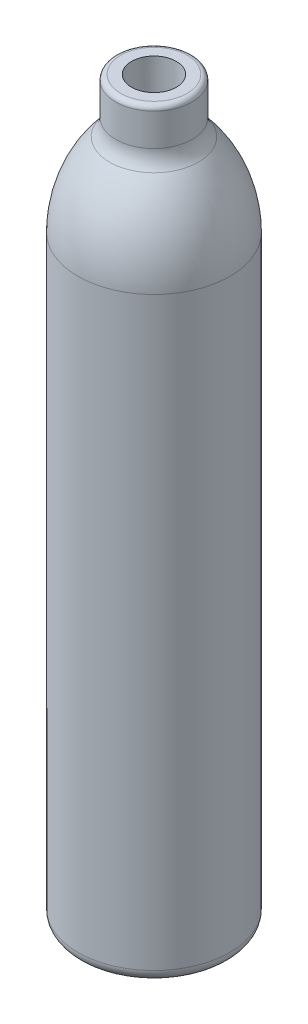
ISO-10303-21;
HEADER;
FILE_DESCRIPTION(('STEP AP214'),'2;1');
FILE_NAME('part.step','',(''),(''),'','','');
FILE_SCHEMA(('AUTOMOTIVE_DESIGN { 1 0 10303 214 1 1 1 1 }'));
ENDSEC;
DATA;
#1=APPLICATION_CONTEXT('core data for automotive mechanical design processes');
#2=APPLICATION_PROTOCOL_DEFINITION('international standard','automotive_design',2000,#1);
#3=PRODUCT_CONTEXT('',#1,'mechanical');
#4=PRODUCT('Part','Part','',(#3));
#5=PRODUCT_RELATED_PRODUCT_CATEGORY('part','',(#4));
#6=PRODUCT_DEFINITION_FORMATION('','',#4);
#7=PRODUCT_DEFINITION_CONTEXT('part definition',#1,'design');
#8=PRODUCT_DEFINITION('design','',#6,#7);
#9=PRODUCT_DEFINITION_SHAPE('','',#8);
#10=(LENGTH_UNIT() NAMED_UNIT(*) SI_UNIT(.MILLI.,.METRE.));
#11=(NAMED_UNIT(*) PLANE_ANGLE_UNIT() SI_UNIT($,.RADIAN.));
#12=(NAMED_UNIT(*) SI_UNIT($,.STERADIAN.) SOLID_ANGLE_UNIT());
#13=UNCERTAINTY_MEASURE_WITH_UNIT(LENGTH_MEASURE(1.E-05),#10,'distance_accuracy_value','');
#14=(GEOMETRIC_REPRESENTATION_CONTEXT(3) GLOBAL_UNCERTAINTY_ASSIGNED_CONTEXT((#13)) GLOBAL_UNIT_ASSIGNED_CONTEXT((#10,
#11,#12)) REPRESENTATION_CONTEXT('',''));
#15=CARTESIAN_POINT('',(0.,0.,0.));
#16=DIRECTION('',(0.,0.,1.));
#17=DIRECTION('',(1.,0.,0.));
#18=AXIS2_PLACEMENT_3D('',#15,#16,#17);
#19=CARTESIAN_POINT('',(13.3,129.302861252312,0.));
#20=DIRECTION('',(0.,-1.,0.));
#21=DIRECTION('',(1.,0.,0.));
#22=AXIS2_PLACEMENT_3D('',#19,#20,#21);
#23=PLANE('',#22);
#24=CARTESIAN_POINT('',(0.,129.302861252312,0.));
#25=DIRECTION('',(0.,-1.,0.));
#26=DIRECTION('',(1.,0.,0.));
#27=AXIS2_PLACEMENT_3D('',#24,#25,#26);
#28=CIRCLE('',#27,9.);
#29=CARTESIAN_POINT('',(9.,129.302861252312,0.));
#30=VERTEX_POINT('',#29);
#31=EDGE_CURVE('E74',#30,#30,#28,.F.);
#32=ORIENTED_EDGE('',*,*,#31,.F.);
#33=EDGE_LOOP('',(#32));
#34=FACE_BOUND('',#33,.T.);
#35=CARTESIAN_POINT('',(0.,129.302861252312,0.));
#36=DIRECTION('',(0.,1.,0.));
#37=DIRECTION('',(-1.,0.,0.));
#38=AXIS2_PLACEMENT_3D('',#35,#36,#37);
#39=CIRCLE('',#38,13.3);
#40=CARTESIAN_POINT('',(-13.3,129.302861252312,0.));
#41=VERTEX_POINT('',#40);
#42=EDGE_CURVE('E12',#41,#41,#39,.T.);
#43=ORIENTED_EDGE('',*,*,#42,.T.);
#44=EDGE_LOOP('',(#43));
#45=FACE_BOUND('',#44,.T.);
#46=ADVANCED_FACE('F46',(#34,#45),#23,.F.);
#47=CARTESIAN_POINT('',(0.,127.302861252312,0.));
#48=DIRECTION('',(0.,1.,0.));
#49=DIRECTION('',(-1.,0.,0.));
#50=AXIS2_PLACEMENT_3D('',#47,#48,#49);
#51=TOROIDAL_SURFACE('',#50,13.3,2.);
#52=ORIENTED_EDGE('',*,*,#42,.F.);
#53=EDGE_LOOP('',(#52));
#54=FACE_BOUND('',#53,.T.);
#55=CARTESIAN_POINT('',(0.,127.302861252312,0.));
#56=DIRECTION('',(0.,1.,0.));
#57=DIRECTION('',(-1.,0.,0.));
#58=AXIS2_PLACEMENT_3D('',#55,#56,#57);
#59=CIRCLE('',#58,15.3);
#60=CARTESIAN_POINT('',(-15.3,127.302861252312,0.));
#61=VERTEX_POINT('',#60);
#62=EDGE_CURVE('E52',#61,#61,#59,.T.);
#63=ORIENTED_EDGE('',*,*,#62,.T.);
#64=EDGE_LOOP('',(#63));
#65=FACE_BOUND('',#64,.T.);
#66=ADVANCED_FACE('F108',(#54,#65),#51,.T.);
#67=CARTESIAN_POINT('',(0.,129.302861252312,0.));
#68=DIRECTION('',(0.,1.,0.));
#69=DIRECTION('',(-1.,0.,0.));
#70=AXIS2_PLACEMENT_3D('',#67,#68,#69);
#71=CYLINDRICAL_SURFACE('',#70,15.3);
#72=ORIENTED_EDGE('',*,*,#62,.F.);
#73=EDGE_LOOP('',(#72));
#74=FACE_BOUND('',#73,.T.);
#75=CARTESIAN_POINT('',(0.,114.302861252312,0.));
#76=DIRECTION('',(0.,1.,0.));
#77=DIRECTION('',(-1.,0.,0.));
#78=AXIS2_PLACEMENT_3D('',#75,#76,#77);
#79=CIRCLE('',#78,15.3);
#80=CARTESIAN_POINT('',(-15.3,114.302861252312,0.));
#81=VERTEX_POINT('',#80);
#82=EDGE_CURVE('E56',#81,#81,#79,.T.);
#83=ORIENTED_EDGE('',*,*,#82,.T.);
#84=EDGE_LOOP('',(#83));
#85=FACE_BOUND('',#84,.T.);
#86=ADVANCED_FACE('F113',(#74,#85),#71,.T.);
#87=CARTESIAN_POINT('',(0.,114.302861252312,0.));
#88=DIRECTION('',(0.,1.,0.));
#89=DIRECTION('',(-1.,0.,0.));
#90=AXIS2_PLACEMENT_3D('',#87,#88,#89);
#91=TOROIDAL_SURFACE('',#90,25.3,9.99999999999999);
#92=ORIENTED_EDGE('',*,*,#82,.F.);
#93=EDGE_LOOP('',(#92));
#94=FACE_BOUND('',#93,.T.);
#95=CARTESIAN_POINT('',(0.,107.661826649027,0.));
#96=DIRECTION('',(0.,1.,0.));
#97=DIRECTION('',(-1.,0.,0.));
#98=AXIS2_PLACEMENT_3D('',#95,#96,#97);
#99=CIRCLE('',#98,17.8235931492485);
#100=CARTESIAN_POINT('',(-17.8235931492485,107.661826649027,0.));
#101=VERTEX_POINT('',#100);
#102=EDGE_CURVE('E60',#101,#101,#99,.T.);
#103=ORIENTED_EDGE('',*,*,#102,.T.);
#104=EDGE_LOOP('',(#103));
#105=FACE_BOUND('',#104,.T.);
#106=ADVANCED_FACE('F119',(#94,#105),#91,.F.);
#107=CARTESIAN_POINT('',(0.,74.3028612523125,0.));
#108=DIRECTION('',(0.,1.,0.));
#109=DIRECTION('',(-1.,0.,0.));
#110=AXIS2_PLACEMENT_3D('',#107,#108,#109);
#111=DEGENERATE_TOROIDAL_SURFACE('',#110,19.7315789473684,50.2315789473684,.F.);
#112=ORIENTED_EDGE('',*,*,#102,.F.);
#113=EDGE_LOOP('',(#112));
#114=FACE_BOUND('',#113,.T.);
#115=CARTESIAN_POINT('',(0.,74.3028612523125,0.));
#116=DIRECTION('',(0.,1.,0.));
#117=DIRECTION('',(-1.,0.,0.));
#118=AXIS2_PLACEMENT_3D('',#115,#116,#117);
#119=CIRCLE('',#118,30.5);
#120=CARTESIAN_POINT('',(-30.5,74.3028612523125,0.));
#121=VERTEX_POINT('',#120);
#122=EDGE_CURVE('E65',#121,#121,#119,.T.);
#123=ORIENTED_EDGE('',*,*,#122,.T.);
#124=EDGE_LOOP('',(#123));
#125=FACE_BOUND('',#124,.T.);
#126=ADVANCED_FACE('F125',(#114,#125),#111,.F.);
#127=CARTESIAN_POINT('',(0.,129.302861252312,0.));
#128=DIRECTION('',(0.,1.,0.));
#129=DIRECTION('',(-1.,0.,0.));
#130=AXIS2_PLACEMENT_3D('',#127,#128,#129);
#131=CYLINDRICAL_SURFACE('',#130,30.5);
#132=ORIENTED_EDGE('',*,*,#122,.F.);
#133=EDGE_LOOP('',(#132));
#134=FACE_BOUND('',#133,.T.);
#135=CARTESIAN_POINT('',(0.,-160.697138747687,0.));
#136=DIRECTION('',(0.,1.,0.));
#137=DIRECTION('',(-1.,0.,0.));
#138=AXIS2_PLACEMENT_3D('',#135,#136,#137);
#139=CIRCLE('',#138,30.5);
#140=CARTESIAN_POINT('',(-30.5,-160.697138747687,0.));
#141=VERTEX_POINT('',#140);
#142=EDGE_CURVE('E68',#141,#141,#139,.T.);
#143=ORIENTED_EDGE('',*,*,#142,.T.);
#144=EDGE_LOOP('',(#143));
#145=FACE_BOUND('',#144,.T.);
#146=ADVANCED_FACE('F129',(#134,#145),#131,.T.);
#147=CARTESIAN_POINT('',(0.,-160.697138747688,0.));
#148=DIRECTION('',(0.,1.,0.));
#149=DIRECTION('',(-1.,0.,0.));
#150=AXIS2_PLACEMENT_3D('',#147,#148,#149);
#151=TOROIDAL_SURFACE('',#150,25.5,5.);
#152=ORIENTED_EDGE('',*,*,#142,.F.);
#153=EDGE_LOOP('',(#152));
#154=FACE_BOUND('',#153,.T.);
#155=CARTESIAN_POINT('',(0.,-165.697138747688,0.));
#156=DIRECTION('',(0.,1.,0.));
#157=DIRECTION('',(-1.,0.,0.));
#158=AXIS2_PLACEMENT_3D('',#155,#156,#157);
#159=CIRCLE('',#158,25.5);
#160=CARTESIAN_POINT('',(-25.4999999999999,-165.697138747688,0.));
#161=VERTEX_POINT('',#160);
#162=EDGE_CURVE('E71',#161,#161,#159,.T.);
#163=ORIENTED_EDGE('',*,*,#162,.T.);
#164=EDGE_LOOP('',(#163));
#165=FACE_BOUND('',#164,.T.);
#166=ADVANCED_FACE('F104',(#154,#165),#151,.T.);
#167=CARTESIAN_POINT('',(25.5,-165.697138747688,0.));
#168=DIRECTION('',(0.,1.,0.));
#169=DIRECTION('',(-1.,0.,0.));
#170=AXIS2_PLACEMENT_3D('',#167,#168,#169);
#171=PLANE('',#170);
#172=ORIENTED_EDGE('',*,*,#162,.F.);
#173=EDGE_LOOP('',(#172));
#174=FACE_BOUND('',#173,.T.);
#175=ADVANCED_FACE('F95',(#174),#171,.F.);
#176=CARTESIAN_POINT('',(0.,129.302861252312,0.));
#177=DIRECTION('',(0.,1.,0.));
#178=DIRECTION('',(-1.,0.,0.));
#179=AXIS2_PLACEMENT_3D('',#176,#177,#178);
#180=CYLINDRICAL_SURFACE('',#179,9.);
#181=ORIENTED_EDGE('',*,*,#31,.T.);
#182=EDGE_LOOP('',(#181));
#183=FACE_BOUND('',#182,.T.);
#184=CARTESIAN_POINT('',(0.,114.302861252312,0.));
#185=DIRECTION('',(0.,1.,0.));
#186=DIRECTION('',(-1.,0.,0.));
#187=AXIS2_PLACEMENT_3D('',#184,#185,#186);
#188=CIRCLE('',#187,9.);
#189=CARTESIAN_POINT('',(-8.99999999999999,114.302861252312,0.));
#190=VERTEX_POINT('',#189);
#191=EDGE_CURVE('E77',#190,#190,#188,.T.);
#192=ORIENTED_EDGE('',*,*,#191,.F.);
#193=EDGE_LOOP('',(#192));
#194=FACE_BOUND('',#193,.T.);
#195=ADVANCED_FACE('F93',(#183,#194),#180,.F.);
#196=CARTESIAN_POINT('',(0.,114.302861252312,0.));
#197=DIRECTION('',(0.,1.,0.));
#198=DIRECTION('',(-1.,0.,0.));
#199=AXIS2_PLACEMENT_3D('',#196,#197,#198);
#200=TOROIDAL_SURFACE('',#199,25.3,16.3);
#201=ORIENTED_EDGE('',*,*,#191,.T.);
#202=EDGE_LOOP('',(#201));
#203=FACE_BOUND('',#202,.T.);
#204=CARTESIAN_POINT('',(0.,103.477974848957,0.));
#205=DIRECTION('',(0.,1.,0.));
#206=DIRECTION('',(-1.,0.,0.));
#207=AXIS2_PLACEMENT_3D('',#204,#205,#206);
#208=CIRCLE('',#207,13.1134568332751);
#209=CARTESIAN_POINT('',(-13.1134568332751,103.477974848957,0.));
#210=VERTEX_POINT('',#209);
#211=EDGE_CURVE('E84',#210,#210,#208,.T.);
#212=ORIENTED_EDGE('',*,*,#211,.F.);
#213=EDGE_LOOP('',(#212));
#214=FACE_BOUND('',#213,.T.);
#215=ADVANCED_FACE('F90',(#203,#214),#200,.T.);
#216=CARTESIAN_POINT('',(0.,74.3028612523125,0.));
#217=DIRECTION('',(0.,1.,0.));
#218=DIRECTION('',(-1.,0.,0.));
#219=AXIS2_PLACEMENT_3D('',#216,#217,#218);
#220=DEGENERATE_TOROIDAL_SURFACE('',#219,19.7315789473684,43.9315789473684,.F.);
#221=ORIENTED_EDGE('',*,*,#211,.T.);
#222=EDGE_LOOP('',(#221));
#223=FACE_BOUND('',#222,.T.);
#224=CARTESIAN_POINT('',(0.,74.3028612523125,0.));
#225=DIRECTION('',(0.,1.,0.));
#226=DIRECTION('',(-1.,0.,0.));
#227=AXIS2_PLACEMENT_3D('',#224,#225,#226);
#228=CIRCLE('',#227,24.2);
#229=CARTESIAN_POINT('',(-24.2,74.3028612523125,0.));
#230=VERTEX_POINT('',#229);
#231=EDGE_CURVE('E81',#230,#230,#228,.T.);
#232=ORIENTED_EDGE('',*,*,#231,.F.);
#233=EDGE_LOOP('',(#232));
#234=FACE_BOUND('',#233,.T.);
#235=ADVANCED_FACE('F102',(#223,#234),#220,.T.);
#236=CARTESIAN_POINT('',(0.,129.302861252312,0.));
#237=DIRECTION('',(0.,1.,0.));
#238=DIRECTION('',(-1.,0.,0.));
#239=AXIS2_PLACEMENT_3D('',#236,#237,#238);
#240=CYLINDRICAL_SURFACE('',#239,24.2);
#241=ORIENTED_EDGE('',*,*,#231,.T.);
#242=EDGE_LOOP('',(#241));
#243=FACE_BOUND('',#242,.T.);
#244=CARTESIAN_POINT('',(0.,-159.397138747687,0.));
#245=DIRECTION('',(0.,1.,0.));
#246=DIRECTION('',(-1.,0.,0.));
#247=AXIS2_PLACEMENT_3D('',#244,#245,#246);
#248=CIRCLE('',#247,24.2);
#249=CARTESIAN_POINT('',(-24.2,-159.397138747687,0.));
#250=VERTEX_POINT('',#249);
#251=EDGE_CURVE('E78',#250,#250,#248,.T.);
#252=ORIENTED_EDGE('',*,*,#251,.F.);
#253=EDGE_LOOP('',(#252));
#254=FACE_BOUND('',#253,.T.);
#255=ADVANCED_FACE('F140',(#243,#254),#240,.F.);
#256=CARTESIAN_POINT('',(25.5,-159.397138747688,0.));
#257=DIRECTION('',(0.,1.,0.));
#258=DIRECTION('',(-1.,0.,0.));
#259=AXIS2_PLACEMENT_3D('',#256,#257,#258);
#260=PLANE('',#259);
#261=ORIENTED_EDGE('',*,*,#251,.T.);
#262=EDGE_LOOP('',(#261));
#263=FACE_BOUND('',#262,.T.);
#264=ADVANCED_FACE('F137',(#263),#260,.T.);
#265=CLOSED_SHELL('',(#46,#66,#86,#106,#126,#146,#166,#175,#195,#215,#235,#255,#264));
#266=MANIFOLD_SOLID_BREP('B2',#265);
#267=ADVANCED_BREP_SHAPE_REPRESENTATION('',(#18,#266),#14);
#268=SHAPE_DEFINITION_REPRESENTATION(#9,#267);
ENDSEC;
END-ISO-10303-21;
